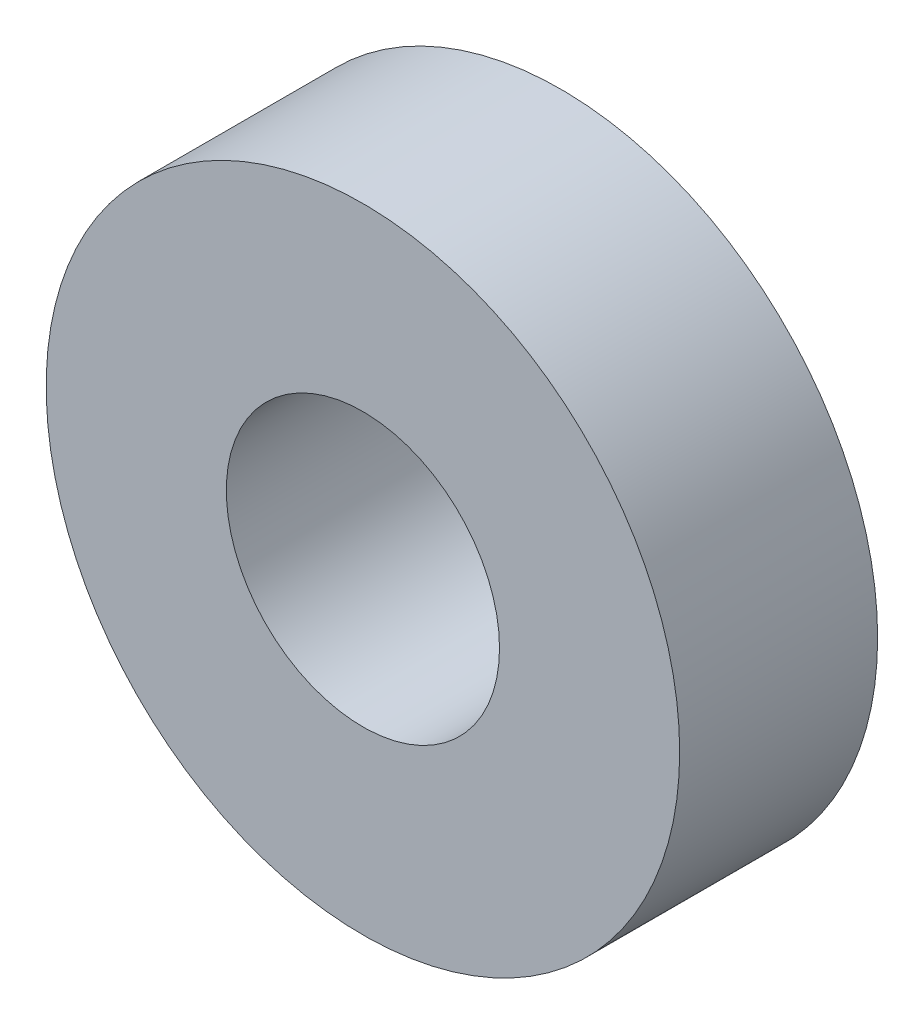
ISO-10303-21;
HEADER;
FILE_DESCRIPTION(('STEP AP214'),'2;1');
FILE_NAME('part.step','',(''),(''),'','','');
FILE_SCHEMA(('AUTOMOTIVE_DESIGN { 1 0 10303 214 1 1 1 1 }'));
ENDSEC;
DATA;
#1=APPLICATION_CONTEXT('core data for automotive mechanical design processes');
#2=APPLICATION_PROTOCOL_DEFINITION('international standard','automotive_design',2000,#1);
#3=PRODUCT_CONTEXT('',#1,'mechanical');
#4=PRODUCT('Part','Part','',(#3));
#5=PRODUCT_RELATED_PRODUCT_CATEGORY('part','',(#4));
#6=PRODUCT_DEFINITION_FORMATION('','',#4);
#7=PRODUCT_DEFINITION_CONTEXT('part definition',#1,'design');
#8=PRODUCT_DEFINITION('design','',#6,#7);
#9=PRODUCT_DEFINITION_SHAPE('','',#8);
#10=(LENGTH_UNIT() NAMED_UNIT(*) SI_UNIT(.MILLI.,.METRE.));
#11=(NAMED_UNIT(*) PLANE_ANGLE_UNIT() SI_UNIT($,.RADIAN.));
#12=(NAMED_UNIT(*) SI_UNIT($,.STERADIAN.) SOLID_ANGLE_UNIT());
#13=UNCERTAINTY_MEASURE_WITH_UNIT(LENGTH_MEASURE(1.E-05),#10,'distance_accuracy_value','');
#14=(GEOMETRIC_REPRESENTATION_CONTEXT(3) GLOBAL_UNCERTAINTY_ASSIGNED_CONTEXT((#13)) GLOBAL_UNIT_ASSIGNED_CONTEXT((#10,
#11,#12)) REPRESENTATION_CONTEXT('',''));
#15=CARTESIAN_POINT('',(0.,0.,0.));
#16=DIRECTION('',(0.,0.,1.));
#17=DIRECTION('',(1.,0.,0.));
#18=AXIS2_PLACEMENT_3D('',#15,#16,#17);
#19=CARTESIAN_POINT('',(0.,0.,2.5));
#20=DIRECTION('',(0.,0.,1.));
#21=DIRECTION('',(1.,0.,0.));
#22=AXIS2_PLACEMENT_3D('',#19,#20,#21);
#23=PLANE('',#22);
#24=CARTESIAN_POINT('',(0.,0.,2.5));
#25=DIRECTION('',(0.,0.,1.));
#26=DIRECTION('',(1.,0.,0.));
#27=AXIS2_PLACEMENT_3D('',#24,#25,#26);
#28=CIRCLE('',#27,4.);
#29=CARTESIAN_POINT('',(4.,0.,2.5));
#30=VERTEX_POINT('',#29);
#31=EDGE_CURVE('E10',#30,#30,#28,.T.);
#32=ORIENTED_EDGE('',*,*,#31,.T.);
#33=EDGE_LOOP('',(#32));
#34=FACE_BOUND('',#33,.T.);
#35=CARTESIAN_POINT('',(0.,0.,2.5));
#36=DIRECTION('',(0.,0.,1.));
#37=DIRECTION('',(1.,0.,0.));
#38=AXIS2_PLACEMENT_3D('',#35,#36,#37);
#39=CIRCLE('',#38,1.725);
#40=CARTESIAN_POINT('',(1.725,0.,2.5));
#41=VERTEX_POINT('',#40);
#42=EDGE_CURVE('E41',#41,#41,#39,.T.);
#43=ORIENTED_EDGE('',*,*,#42,.F.);
#44=EDGE_LOOP('',(#43));
#45=FACE_BOUND('',#44,.T.);
#46=ADVANCED_FACE('F30',(#34,#45),#23,.T.);
#47=CARTESIAN_POINT('',(0.,0.,0.));
#48=DIRECTION('',(0.,0.,1.));
#49=DIRECTION('',(1.,0.,0.));
#50=AXIS2_PLACEMENT_3D('',#47,#48,#49);
#51=PLANE('',#50);
#52=CARTESIAN_POINT('',(0.,0.,0.));
#53=DIRECTION('',(0.,0.,1.));
#54=DIRECTION('',(1.,0.,0.));
#55=AXIS2_PLACEMENT_3D('',#52,#53,#54);
#56=CIRCLE('',#55,4.);
#57=CARTESIAN_POINT('',(4.,0.,0.));
#58=VERTEX_POINT('',#57);
#59=EDGE_CURVE('E34',#58,#58,#56,.T.);
#60=ORIENTED_EDGE('',*,*,#59,.F.);
#61=EDGE_LOOP('',(#60));
#62=FACE_BOUND('',#61,.T.);
#63=CARTESIAN_POINT('',(0.,0.,0.));
#64=DIRECTION('',(0.,0.,1.));
#65=DIRECTION('',(1.,0.,0.));
#66=AXIS2_PLACEMENT_3D('',#63,#64,#65);
#67=CIRCLE('',#66,1.725);
#68=CARTESIAN_POINT('',(1.725,0.,0.));
#69=VERTEX_POINT('',#68);
#70=EDGE_CURVE('E43',#69,#69,#67,.T.);
#71=ORIENTED_EDGE('',*,*,#70,.T.);
#72=EDGE_LOOP('',(#71));
#73=FACE_BOUND('',#72,.T.);
#74=ADVANCED_FACE('F53',(#62,#73),#51,.F.);
#75=CARTESIAN_POINT('',(0.,0.,2.5));
#76=DIRECTION('',(0.,0.,-1.));
#77=DIRECTION('',(-1.,0.,0.));
#78=AXIS2_PLACEMENT_3D('',#75,#76,#77);
#79=CYLINDRICAL_SURFACE('',#78,4.);
#80=ORIENTED_EDGE('',*,*,#31,.F.);
#81=EDGE_LOOP('',(#80));
#82=FACE_BOUND('',#81,.T.);
#83=ORIENTED_EDGE('',*,*,#59,.T.);
#84=EDGE_LOOP('',(#83));
#85=FACE_BOUND('',#84,.T.);
#86=ADVANCED_FACE('F32',(#82,#85),#79,.T.);
#87=CARTESIAN_POINT('',(0.,0.,2.5));
#88=DIRECTION('',(0.,0.,-1.));
#89=DIRECTION('',(-1.,0.,0.));
#90=AXIS2_PLACEMENT_3D('',#87,#88,#89);
#91=CYLINDRICAL_SURFACE('',#90,1.725);
#92=ORIENTED_EDGE('',*,*,#42,.T.);
#93=EDGE_LOOP('',(#92));
#94=FACE_BOUND('',#93,.T.);
#95=ORIENTED_EDGE('',*,*,#70,.F.);
#96=EDGE_LOOP('',(#95));
#97=FACE_BOUND('',#96,.T.);
#98=ADVANCED_FACE('F49',(#94,#97),#91,.F.);
#99=CLOSED_SHELL('',(#46,#74,#86,#98));
#100=MANIFOLD_SOLID_BREP('B2',#99);
#101=ADVANCED_BREP_SHAPE_REPRESENTATION('',(#18,#100),#14);
#102=SHAPE_DEFINITION_REPRESENTATION(#9,#101);
ENDSEC;
END-ISO-10303-21;
